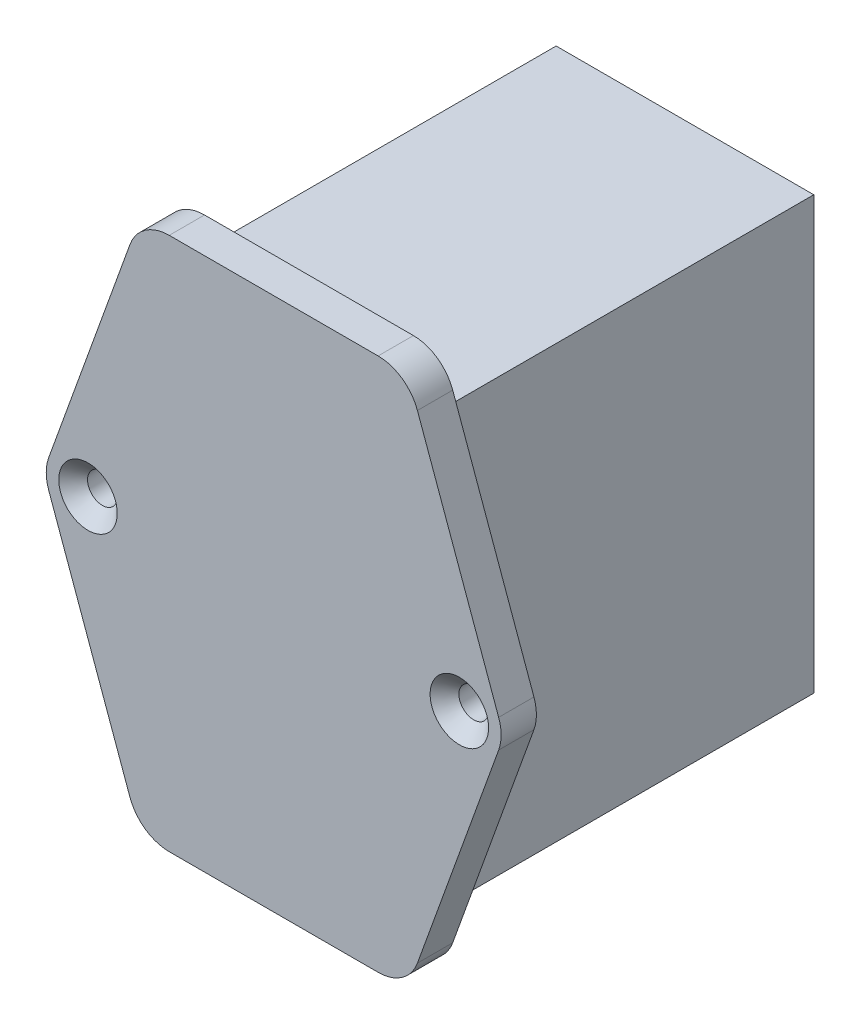
ISO-10303-21;
HEADER;
FILE_DESCRIPTION(('STEP AP214'),'2;1');
FILE_NAME('part.step','',(''),(''),'','','');
FILE_SCHEMA(('AUTOMOTIVE_DESIGN { 1 0 10303 214 1 1 1 1 }'));
ENDSEC;
DATA;
#1=APPLICATION_CONTEXT('core data for automotive mechanical design processes');
#2=APPLICATION_PROTOCOL_DEFINITION('international standard','automotive_design',2000,#1);
#3=PRODUCT_CONTEXT('',#1,'mechanical');
#4=PRODUCT('Part','Part','',(#3));
#5=PRODUCT_RELATED_PRODUCT_CATEGORY('part','',(#4));
#6=PRODUCT_DEFINITION_FORMATION('','',#4);
#7=PRODUCT_DEFINITION_CONTEXT('part definition',#1,'design');
#8=PRODUCT_DEFINITION('design','',#6,#7);
#9=PRODUCT_DEFINITION_SHAPE('','',#8);
#10=(LENGTH_UNIT() NAMED_UNIT(*) SI_UNIT(.MILLI.,.METRE.));
#11=(NAMED_UNIT(*) PLANE_ANGLE_UNIT() SI_UNIT($,.RADIAN.));
#12=(NAMED_UNIT(*) SI_UNIT($,.STERADIAN.) SOLID_ANGLE_UNIT());
#13=UNCERTAINTY_MEASURE_WITH_UNIT(LENGTH_MEASURE(1.E-05),#10,'distance_accuracy_value','');
#14=(GEOMETRIC_REPRESENTATION_CONTEXT(3) GLOBAL_UNCERTAINTY_ASSIGNED_CONTEXT((#13)) GLOBAL_UNIT_ASSIGNED_CONTEXT((#10,
#11,#12)) REPRESENTATION_CONTEXT('',''));
#15=CARTESIAN_POINT('',(0.,0.,0.));
#16=DIRECTION('',(0.,0.,1.));
#17=DIRECTION('',(1.,0.,0.));
#18=AXIS2_PLACEMENT_3D('',#15,#16,#17);
#19=CARTESIAN_POINT('',(0.,0.,0.));
#20=DIRECTION('',(0.,0.,-1.));
#21=DIRECTION('',(-1.,0.,0.));
#22=AXIS2_PLACEMENT_3D('',#19,#20,#21);
#23=PLANE('',#22);
#24=DIRECTION('',(0.,1.,0.));
#25=VECTOR('',#24,1.);
#26=CARTESIAN_POINT('',(27.75,0.,0.));
#27=LINE('',#26,#25);
#28=CARTESIAN_POINT('',(27.75,46.5,0.));
#29=VERTEX_POINT('',#28);
#30=CARTESIAN_POINT('',(27.75,0.,0.));
#31=VERTEX_POINT('',#30);
#32=EDGE_CURVE('E233',#29,#31,#27,.F.);
#33=ORIENTED_EDGE('',*,*,#32,.T.);
#34=DIRECTION('',(1.,0.,0.));
#35=VECTOR('',#34,1.);
#36=CARTESIAN_POINT('',(0.,0.,0.));
#37=LINE('',#36,#35);
#38=CARTESIAN_POINT('',(0.,0.,0.));
#39=VERTEX_POINT('',#38);
#40=EDGE_CURVE('E227',#31,#39,#37,.F.);
#41=ORIENTED_EDGE('',*,*,#40,.T.);
#42=DIRECTION('',(0.,1.,0.));
#43=VECTOR('',#42,1.);
#44=CARTESIAN_POINT('',(0.,0.,0.));
#45=LINE('',#44,#43);
#46=CARTESIAN_POINT('',(0.,46.5,0.));
#47=VERTEX_POINT('',#46);
#48=EDGE_CURVE('E221',#39,#47,#45,.T.);
#49=ORIENTED_EDGE('',*,*,#48,.T.);
#50=DIRECTION('',(1.,0.,0.));
#51=VECTOR('',#50,1.);
#52=CARTESIAN_POINT('',(0.,46.5,0.));
#53=LINE('',#52,#51);
#54=EDGE_CURVE('E117',#47,#29,#53,.T.);
#55=ORIENTED_EDGE('',*,*,#54,.T.);
#56=EDGE_LOOP('',(#33,#41,#49,#55));
#57=FACE_BOUND('',#56,.T.);
#58=ADVANCED_FACE('F17',(#57),#23,.T.);
#59=CARTESIAN_POINT('',(27.75,0.,40.5));
#60=DIRECTION('',(-1.,0.,0.));
#61=DIRECTION('',(0.,0.,1.));
#62=AXIS2_PLACEMENT_3D('',#59,#60,#61);
#63=PLANE('',#62);
#64=DIRECTION('',(0.,0.,-1.));
#65=VECTOR('',#64,1.);
#66=CARTESIAN_POINT('',(27.75,46.5,40.5));
#67=LINE('',#66,#65);
#68=CARTESIAN_POINT('',(27.75,46.5,40.5));
#69=VERTEX_POINT('',#68);
#70=EDGE_CURVE('E218',#29,#69,#67,.F.);
#71=ORIENTED_EDGE('',*,*,#70,.T.);
#72=DIRECTION('',(0.,1.,0.));
#73=VECTOR('',#72,1.);
#74=CARTESIAN_POINT('',(27.75,23.55,40.5));
#75=LINE('',#74,#73);
#76=CARTESIAN_POINT('',(27.75,0.,40.5));
#77=VERTEX_POINT('',#76);
#78=EDGE_CURVE('E192',#69,#77,#75,.F.);
#79=ORIENTED_EDGE('',*,*,#78,.T.);
#80=DIRECTION('',(0.,0.,1.));
#81=VECTOR('',#80,1.);
#82=CARTESIAN_POINT('',(27.75,0.,40.5));
#83=LINE('',#82,#81);
#84=EDGE_CURVE('E230',#77,#31,#83,.F.);
#85=ORIENTED_EDGE('',*,*,#84,.T.);
#86=ORIENTED_EDGE('',*,*,#32,.F.);
#87=EDGE_LOOP('',(#71,#79,#85,#86));
#88=FACE_BOUND('',#87,.T.);
#89=ADVANCED_FACE('F470',(#88),#63,.F.);
#90=CARTESIAN_POINT('',(0.,0.,40.5));
#91=DIRECTION('',(0.,1.,0.));
#92=DIRECTION('',(0.,0.,1.));
#93=AXIS2_PLACEMENT_3D('',#90,#91,#92);
#94=PLANE('',#93);
#95=ORIENTED_EDGE('',*,*,#84,.F.);
#96=DIRECTION('',(1.,0.,0.));
#97=VECTOR('',#96,1.);
#98=CARTESIAN_POINT('',(33.875,0.,40.5));
#99=LINE('',#98,#97);
#100=CARTESIAN_POINT('',(0.,0.,40.5));
#101=VERTEX_POINT('',#100);
#102=EDGE_CURVE('E189',#77,#101,#99,.F.);
#103=ORIENTED_EDGE('',*,*,#102,.T.);
#104=DIRECTION('',(0.,0.,-1.));
#105=VECTOR('',#104,1.);
#106=CARTESIAN_POINT('',(0.,0.,40.5));
#107=LINE('',#106,#105);
#108=EDGE_CURVE('E224',#101,#39,#107,.T.);
#109=ORIENTED_EDGE('',*,*,#108,.T.);
#110=ORIENTED_EDGE('',*,*,#40,.F.);
#111=EDGE_LOOP('',(#95,#103,#109,#110));
#112=FACE_BOUND('',#111,.T.);
#113=ADVANCED_FACE('F461',(#112),#94,.F.);
#114=CARTESIAN_POINT('',(0.,0.,40.5));
#115=DIRECTION('',(1.,0.,0.));
#116=DIRECTION('',(0.,0.,-1.));
#117=AXIS2_PLACEMENT_3D('',#114,#115,#116);
#118=PLANE('',#117);
#119=ORIENTED_EDGE('',*,*,#108,.F.);
#120=DIRECTION('',(0.,1.,0.));
#121=VECTOR('',#120,1.);
#122=CARTESIAN_POINT('',(0.,23.55,40.5));
#123=LINE('',#122,#121);
#124=CARTESIAN_POINT('',(0.,46.5,40.5));
#125=VERTEX_POINT('',#124);
#126=EDGE_CURVE('E186',#101,#125,#123,.T.);
#127=ORIENTED_EDGE('',*,*,#126,.T.);
#128=DIRECTION('',(0.,0.,-1.));
#129=VECTOR('',#128,1.);
#130=CARTESIAN_POINT('',(0.,46.5,40.5));
#131=LINE('',#130,#129);
#132=EDGE_CURVE('E215',#125,#47,#131,.T.);
#133=ORIENTED_EDGE('',*,*,#132,.T.);
#134=ORIENTED_EDGE('',*,*,#48,.F.);
#135=EDGE_LOOP('',(#119,#127,#133,#134));
#136=FACE_BOUND('',#135,.T.);
#137=ADVANCED_FACE('F452',(#136),#118,.F.);
#138=CARTESIAN_POINT('',(0.,46.5,40.5));
#139=DIRECTION('',(0.,-1.,0.));
#140=DIRECTION('',(0.,0.,-1.));
#141=AXIS2_PLACEMENT_3D('',#138,#139,#140);
#142=PLANE('',#141);
#143=ORIENTED_EDGE('',*,*,#132,.F.);
#144=DIRECTION('',(1.,0.,0.));
#145=VECTOR('',#144,1.);
#146=CARTESIAN_POINT('',(33.875,46.5,40.5));
#147=LINE('',#146,#145);
#148=EDGE_CURVE('E182',#125,#69,#147,.T.);
#149=ORIENTED_EDGE('',*,*,#148,.T.);
#150=ORIENTED_EDGE('',*,*,#70,.F.);
#151=ORIENTED_EDGE('',*,*,#54,.F.);
#152=EDGE_LOOP('',(#143,#149,#150,#151));
#153=FACE_BOUND('',#152,.T.);
#154=ADVANCED_FACE('F443',(#153),#142,.F.);
#155=CARTESIAN_POINT('',(-6.125,23.55,44.3));
#156=DIRECTION('',(0.,0.,-1.));
#157=DIRECTION('',(-1.,0.,0.));
#158=AXIS2_PLACEMENT_3D('',#155,#156,#157);
#159=CYLINDRICAL_SURFACE('',#158,1.6);
#160=CARTESIAN_POINT('',(-6.125,23.55,40.5));
#161=DIRECTION('',(0.,0.,-1.));
#162=DIRECTION('',(-1.,0.,0.));
#163=AXIS2_PLACEMENT_3D('',#160,#161,#162);
#164=CIRCLE('',#163,1.6);
#165=CARTESIAN_POINT('',(-7.725,23.55,40.5));
#166=VERTEX_POINT('',#165);
#167=EDGE_CURVE('E256',#166,#166,#164,.T.);
#168=ORIENTED_EDGE('',*,*,#167,.T.);
#169=EDGE_LOOP('',(#168));
#170=FACE_BOUND('',#169,.T.);
#171=CARTESIAN_POINT('',(-6.125,23.55,42.7500000000123));
#172=DIRECTION('',(0.,0.,1.));
#173=DIRECTION('',(1.,0.,0.));
#174=AXIS2_PLACEMENT_3D('',#171,#172,#173);
#175=CIRCLE('',#174,1.599999999999);
#176=CARTESIAN_POINT('',(-4.525000000001,23.55,42.7500000000123));
#177=VERTEX_POINT('',#176);
#178=EDGE_CURVE('E185',#177,#177,#175,.T.);
#179=ORIENTED_EDGE('',*,*,#178,.T.);
#180=EDGE_LOOP('',(#179));
#181=FACE_BOUND('',#180,.T.);
#182=ADVANCED_FACE('F434',(#170,#181),#159,.F.);
#183=CARTESIAN_POINT('',(33.875,23.55,44.3));
#184=DIRECTION('',(0.,0.,-1.));
#185=DIRECTION('',(-1.,0.,0.));
#186=AXIS2_PLACEMENT_3D('',#183,#184,#185);
#187=CYLINDRICAL_SURFACE('',#186,1.6);
#188=CARTESIAN_POINT('',(33.875,23.55,40.5));
#189=DIRECTION('',(0.,0.,-1.));
#190=DIRECTION('',(-1.,0.,0.));
#191=AXIS2_PLACEMENT_3D('',#188,#189,#190);
#192=CIRCLE('',#191,1.6);
#193=CARTESIAN_POINT('',(32.275,23.55,40.5));
#194=VERTEX_POINT('',#193);
#195=EDGE_CURVE('E195',#194,#194,#192,.T.);
#196=ORIENTED_EDGE('',*,*,#195,.T.);
#197=EDGE_LOOP('',(#196));
#198=FACE_BOUND('',#197,.T.);
#199=CARTESIAN_POINT('',(33.875,23.55,42.7499999999554));
#200=DIRECTION('',(0.,0.,1.));
#201=DIRECTION('',(1.,0.,0.));
#202=AXIS2_PLACEMENT_3D('',#199,#200,#201);
#203=CIRCLE('',#202,1.59999999996262);
#204=CARTESIAN_POINT('',(35.4749999999626,23.55,42.7499999999554));
#205=VERTEX_POINT('',#204);
#206=EDGE_CURVE('E208',#205,#205,#203,.T.);
#207=ORIENTED_EDGE('',*,*,#206,.T.);
#208=EDGE_LOOP('',(#207));
#209=FACE_BOUND('',#208,.T.);
#210=ADVANCED_FACE('F426',(#198,#209),#187,.F.);
#211=CARTESIAN_POINT('',(-6.125,23.55,44.3));
#212=DIRECTION('',(0.,0.,-1.));
#213=DIRECTION('',(-1.,0.,0.));
#214=AXIS2_PLACEMENT_3D('',#211,#212,#213);
#215=CYLINDRICAL_SURFACE('',#214,4.5);
#216=CARTESIAN_POINT('',(-6.125,23.55,40.5));
#217=DIRECTION('',(0.,0.,-1.));
#218=DIRECTION('',(-1.,0.,0.));
#219=AXIS2_PLACEMENT_3D('',#216,#217,#218);
#220=CIRCLE('',#219,4.5);
#221=CARTESIAN_POINT('',(-10.3578796435891,25.0773277064497,40.5));
#222=VERTEX_POINT('',#221);
#223=CARTESIAN_POINT('',(-10.3578796435891,22.0226722935503,40.5));
#224=VERTEX_POINT('',#223);
#225=EDGE_CURVE('E116',#222,#224,#220,.F.);
#226=ORIENTED_EDGE('',*,*,#225,.T.);
#227=DIRECTION('',(0.,0.,1.));
#228=VECTOR('',#227,1.);
#229=CARTESIAN_POINT('',(-10.3578796435891,22.0226722935503,44.3));
#230=LINE('',#229,#228);
#231=CARTESIAN_POINT('',(-10.3578796435891,22.0226722935503,44.3));
#232=VERTEX_POINT('',#231);
#233=EDGE_CURVE('E114',#224,#232,#230,.T.);
#234=ORIENTED_EDGE('',*,*,#233,.T.);
#235=CARTESIAN_POINT('',(-6.125,23.55,44.3));
#236=DIRECTION('',(0.,0.,-1.));
#237=DIRECTION('',(-1.,0.,0.));
#238=AXIS2_PLACEMENT_3D('',#235,#236,#237);
#239=CIRCLE('',#238,4.5);
#240=CARTESIAN_POINT('',(-10.3578796435891,25.0773277064497,44.3));
#241=VERTEX_POINT('',#240);
#242=EDGE_CURVE('E20',#232,#241,#239,.T.);
#243=ORIENTED_EDGE('',*,*,#242,.T.);
#244=DIRECTION('',(0.,0.,1.));
#245=VECTOR('',#244,1.);
#246=CARTESIAN_POINT('',(-10.3578796435891,25.0773277064497,44.3));
#247=LINE('',#246,#245);
#248=EDGE_CURVE('E111',#241,#222,#247,.F.);
#249=ORIENTED_EDGE('',*,*,#248,.T.);
#250=EDGE_LOOP('',(#226,#234,#243,#249));
#251=FACE_BOUND('',#250,.T.);
#252=ADVANCED_FACE('F110',(#251),#215,.T.);
#253=CARTESIAN_POINT('',(33.875,23.55,40.5));
#254=DIRECTION('',(0.,0.,1.));
#255=DIRECTION('',(1.,0.,0.));
#256=AXIS2_PLACEMENT_3D('',#253,#254,#255);
#257=PLANE('',#256);
#258=ORIENTED_EDGE('',*,*,#126,.F.);
#259=ORIENTED_EDGE('',*,*,#102,.F.);
#260=ORIENTED_EDGE('',*,*,#78,.F.);
#261=ORIENTED_EDGE('',*,*,#148,.F.);
#262=EDGE_LOOP('',(#258,#259,#260,#261));
#263=FACE_BOUND('',#262,.T.);
#264=ORIENTED_EDGE('',*,*,#195,.F.);
#265=EDGE_LOOP('',(#264));
#266=FACE_BOUND('',#265,.T.);
#267=ORIENTED_EDGE('',*,*,#167,.F.);
#268=EDGE_LOOP('',(#267));
#269=FACE_BOUND('',#268,.T.);
#270=DIRECTION('',(-0.339406156988818,-0.940639920797582,0.));
#271=VECTOR('',#270,1.);
#272=CARTESIAN_POINT('',(29.3578796435891,-2.22732770644969,40.5));
#273=LINE('',#272,#271);
#274=CARTESIAN_POINT('',(38.1078796435891,22.0226722935503,40.5));
#275=VERTEX_POINT('',#274);
#276=CARTESIAN_POINT('',(29.3578796435891,-2.22732770644969,40.5));
#277=VERTEX_POINT('',#276);
#278=EDGE_CURVE('E153',#275,#277,#273,.T.);
#279=ORIENTED_EDGE('',*,*,#278,.T.);
#280=CARTESIAN_POINT('',(25.125,-0.700000000000004,40.5));
#281=DIRECTION('',(0.,0.,-1.));
#282=DIRECTION('',(-1.,0.,0.));
#283=AXIS2_PLACEMENT_3D('',#280,#281,#282);
#284=CIRCLE('',#283,4.5);
#285=CARTESIAN_POINT('',(25.125,-5.2,40.5));
#286=VERTEX_POINT('',#285);
#287=EDGE_CURVE('E156',#286,#277,#284,.F.);
#288=ORIENTED_EDGE('',*,*,#287,.F.);
#289=DIRECTION('',(-1.,0.,0.));
#290=VECTOR('',#289,1.);
#291=CARTESIAN_POINT('',(2.625,-5.2,40.5));
#292=LINE('',#291,#290);
#293=CARTESIAN_POINT('',(2.625,-5.2,40.5));
#294=VERTEX_POINT('',#293);
#295=EDGE_CURVE('E159',#286,#294,#292,.T.);
#296=ORIENTED_EDGE('',*,*,#295,.T.);
#297=CARTESIAN_POINT('',(2.625,-0.700000000000004,40.5));
#298=DIRECTION('',(0.,0.,-1.));
#299=DIRECTION('',(-1.,0.,0.));
#300=AXIS2_PLACEMENT_3D('',#297,#298,#299);
#301=CIRCLE('',#300,4.5);
#302=CARTESIAN_POINT('',(-1.60787964358912,-2.22732770644969,40.5));
#303=VERTEX_POINT('',#302);
#304=EDGE_CURVE('E163',#303,#294,#301,.F.);
#305=ORIENTED_EDGE('',*,*,#304,.F.);
#306=DIRECTION('',(-0.339406156988818,0.940639920797582,0.));
#307=VECTOR('',#306,1.);
#308=CARTESIAN_POINT('',(-10.3578796435891,22.0226722935503,40.5));
#309=LINE('',#308,#307);
#310=EDGE_CURVE('E165',#303,#224,#309,.T.);
#311=ORIENTED_EDGE('',*,*,#310,.T.);
#312=ORIENTED_EDGE('',*,*,#225,.F.);
#313=DIRECTION('',(0.339406156988818,0.940639920797582,0.));
#314=VECTOR('',#313,1.);
#315=CARTESIAN_POINT('',(-1.60787964358912,49.3273277064497,40.5));
#316=LINE('',#315,#314);
#317=CARTESIAN_POINT('',(-1.60787964358912,49.3273277064497,40.5));
#318=VERTEX_POINT('',#317);
#319=EDGE_CURVE('E125',#222,#318,#316,.T.);
#320=ORIENTED_EDGE('',*,*,#319,.T.);
#321=CARTESIAN_POINT('',(2.625,47.8,40.5));
#322=DIRECTION('',(0.,0.,-1.));
#323=DIRECTION('',(-1.,0.,0.));
#324=AXIS2_PLACEMENT_3D('',#321,#322,#323);
#325=CIRCLE('',#324,4.5);
#326=CARTESIAN_POINT('',(2.625,52.3,40.5));
#327=VERTEX_POINT('',#326);
#328=EDGE_CURVE('E170',#327,#318,#325,.F.);
#329=ORIENTED_EDGE('',*,*,#328,.F.);
#330=DIRECTION('',(1.,0.,0.));
#331=VECTOR('',#330,1.);
#332=CARTESIAN_POINT('',(25.125,52.3,40.5));
#333=LINE('',#332,#331);
#334=CARTESIAN_POINT('',(25.125,52.3,40.5));
#335=VERTEX_POINT('',#334);
#336=EDGE_CURVE('E173',#327,#335,#333,.T.);
#337=ORIENTED_EDGE('',*,*,#336,.T.);
#338=CARTESIAN_POINT('',(25.125,47.8,40.5));
#339=DIRECTION('',(0.,0.,-1.));
#340=DIRECTION('',(-1.,0.,0.));
#341=AXIS2_PLACEMENT_3D('',#338,#339,#340);
#342=CIRCLE('',#341,4.5);
#343=CARTESIAN_POINT('',(29.3578796435891,49.3273277064497,40.5));
#344=VERTEX_POINT('',#343);
#345=EDGE_CURVE('E177',#344,#335,#342,.F.);
#346=ORIENTED_EDGE('',*,*,#345,.F.);
#347=DIRECTION('',(0.339406156988818,-0.940639920797582,0.));
#348=VECTOR('',#347,1.);
#349=CARTESIAN_POINT('',(38.1078796435891,25.0773277064497,40.5));
#350=LINE('',#349,#348);
#351=CARTESIAN_POINT('',(38.1078796435891,25.0773277064497,40.5));
#352=VERTEX_POINT('',#351);
#353=EDGE_CURVE('E180',#344,#352,#350,.T.);
#354=ORIENTED_EDGE('',*,*,#353,.T.);
#355=CARTESIAN_POINT('',(33.875,23.55,40.5));
#356=DIRECTION('',(0.,0.,-1.));
#357=DIRECTION('',(-1.,0.,0.));
#358=AXIS2_PLACEMENT_3D('',#355,#356,#357);
#359=CIRCLE('',#358,4.5);
#360=EDGE_CURVE('E181',#275,#352,#359,.F.);
#361=ORIENTED_EDGE('',*,*,#360,.F.);
#362=EDGE_LOOP('',(#279,#288,#296,#305,#311,#312,#320,#329,#337,#346,#354,#361));
#363=FACE_BOUND('',#362,.T.);
#364=ADVANCED_FACE('F260',(#263,#266,#269,#363),#257,.F.);
#365=CARTESIAN_POINT('',(-6.125,23.55,44.2999999999074));
#366=DIRECTION('',(0.,0.,1.));
#367=DIRECTION('',(1.,0.,0.));
#368=AXIS2_PLACEMENT_3D('',#365,#366,#367);
#369=CONICAL_SURFACE('',#368,3.14999999989413,0.785398163397448);
#370=CARTESIAN_POINT('',(-6.125,23.55,44.2999999999643));
#371=DIRECTION('',(0.,0.,1.));
#372=DIRECTION('',(1.,0.,0.));
#373=AXIS2_PLACEMENT_3D('',#370,#371,#372);
#374=CIRCLE('',#373,3.14999999995098);
#375=CARTESIAN_POINT('',(-2.97500000004902,23.55,44.2999999999643));
#376=VERTEX_POINT('',#375);
#377=EDGE_CURVE('E198',#376,#376,#374,.F.);
#378=ORIENTED_EDGE('',*,*,#377,.F.);
#379=EDGE_LOOP('',(#378));
#380=FACE_BOUND('',#379,.T.);
#381=ORIENTED_EDGE('',*,*,#178,.F.);
#382=EDGE_LOOP('',(#381));
#383=FACE_BOUND('',#382,.T.);
#384=ADVANCED_FACE('F401',(#380,#383),#369,.F.);
#385=CARTESIAN_POINT('',(33.875,23.55,44.2999999999643));
#386=DIRECTION('',(0.,0.,1.));
#387=DIRECTION('',(1.,0.,0.));
#388=AXIS2_PLACEMENT_3D('',#385,#386,#387);
#389=CONICAL_SURFACE('',#388,3.14999999997144,0.785398163397448);
#390=CARTESIAN_POINT('',(33.875,23.55,44.3000000000211));
#391=DIRECTION('',(0.,0.,1.));
#392=DIRECTION('',(1.,0.,0.));
#393=AXIS2_PLACEMENT_3D('',#390,#391,#392);
#394=CIRCLE('',#393,3.15000000002828);
#395=CARTESIAN_POINT('',(37.0250000000283,23.55,44.3000000000211));
#396=VERTEX_POINT('',#395);
#397=EDGE_CURVE('E244',#396,#396,#394,.F.);
#398=ORIENTED_EDGE('',*,*,#397,.F.);
#399=EDGE_LOOP('',(#398));
#400=FACE_BOUND('',#399,.T.);
#401=ORIENTED_EDGE('',*,*,#206,.F.);
#402=EDGE_LOOP('',(#401));
#403=FACE_BOUND('',#402,.T.);
#404=ADVANCED_FACE('F393',(#400,#403),#389,.F.);
#405=CARTESIAN_POINT('',(33.875,23.55,44.3));
#406=DIRECTION('',(0.,0.,-1.));
#407=DIRECTION('',(-1.,0.,0.));
#408=AXIS2_PLACEMENT_3D('',#405,#406,#407);
#409=CYLINDRICAL_SURFACE('',#408,4.5);
#410=CARTESIAN_POINT('',(33.875,23.55,44.3));
#411=DIRECTION('',(0.,0.,-1.));
#412=DIRECTION('',(-1.,0.,0.));
#413=AXIS2_PLACEMENT_3D('',#410,#411,#412);
#414=CIRCLE('',#413,4.5);
#415=CARTESIAN_POINT('',(38.1078796435891,22.0226722935503,44.3));
#416=VERTEX_POINT('',#415);
#417=CARTESIAN_POINT('',(38.1078796435891,25.0773277064497,44.3));
#418=VERTEX_POINT('',#417);
#419=EDGE_CURVE('E147',#416,#418,#414,.F.);
#420=ORIENTED_EDGE('',*,*,#419,.F.);
#421=DIRECTION('',(0.,0.,1.));
#422=VECTOR('',#421,1.);
#423=CARTESIAN_POINT('',(38.1078796435891,22.0226722935503,44.3));
#424=LINE('',#423,#422);
#425=EDGE_CURVE('E149',#416,#275,#424,.F.);
#426=ORIENTED_EDGE('',*,*,#425,.T.);
#427=ORIENTED_EDGE('',*,*,#360,.T.);
#428=DIRECTION('',(0.,0.,1.));
#429=VECTOR('',#428,1.);
#430=CARTESIAN_POINT('',(38.1078796435891,25.0773277064497,44.3));
#431=LINE('',#430,#429);
#432=EDGE_CURVE('E178',#352,#418,#431,.T.);
#433=ORIENTED_EDGE('',*,*,#432,.T.);
#434=EDGE_LOOP('',(#420,#426,#427,#433));
#435=FACE_BOUND('',#434,.T.);
#436=ADVANCED_FACE('F278',(#435),#409,.T.);
#437=CARTESIAN_POINT('',(38.1078796435891,25.0773277064497,44.3));
#438=DIRECTION('',(-0.940639920797582,-0.339406156988818,0.));
#439=DIRECTION('',(0.339406156988818,-0.940639920797582,0.));
#440=AXIS2_PLACEMENT_3D('',#437,#438,#439);
#441=PLANE('',#440);
#442=DIRECTION('',(0.,0.,-1.));
#443=VECTOR('',#442,1.);
#444=CARTESIAN_POINT('',(29.3578796435891,49.3273277064497,44.3));
#445=LINE('',#444,#443);
#446=CARTESIAN_POINT('',(29.3578796435891,49.3273277064497,44.3));
#447=VERTEX_POINT('',#446);
#448=EDGE_CURVE('E174',#447,#344,#445,.T.);
#449=ORIENTED_EDGE('',*,*,#448,.F.);
#450=DIRECTION('',(-0.339406156988818,0.940639920797582,0.));
#451=VECTOR('',#450,1.);
#452=CARTESIAN_POINT('',(38.1078796435891,25.0773277064497,44.3));
#453=LINE('',#452,#451);
#454=EDGE_CURVE('E144',#418,#447,#453,.T.);
#455=ORIENTED_EDGE('',*,*,#454,.F.);
#456=ORIENTED_EDGE('',*,*,#432,.F.);
#457=ORIENTED_EDGE('',*,*,#353,.F.);
#458=EDGE_LOOP('',(#449,#455,#456,#457));
#459=FACE_BOUND('',#458,.T.);
#460=ADVANCED_FACE('F283',(#459),#441,.F.);
#461=CARTESIAN_POINT('',(25.125,47.8,44.3));
#462=DIRECTION('',(0.,0.,-1.));
#463=DIRECTION('',(-1.,0.,0.));
#464=AXIS2_PLACEMENT_3D('',#461,#462,#463);
#465=CYLINDRICAL_SURFACE('',#464,4.5);
#466=CARTESIAN_POINT('',(25.125,47.8,44.3));
#467=DIRECTION('',(0.,0.,-1.));
#468=DIRECTION('',(-1.,0.,0.));
#469=AXIS2_PLACEMENT_3D('',#466,#467,#468);
#470=CIRCLE('',#469,4.5);
#471=CARTESIAN_POINT('',(25.125,52.3,44.3));
#472=VERTEX_POINT('',#471);
#473=EDGE_CURVE('E143',#447,#472,#470,.F.);
#474=ORIENTED_EDGE('',*,*,#473,.F.);
#475=ORIENTED_EDGE('',*,*,#448,.T.);
#476=ORIENTED_EDGE('',*,*,#345,.T.);
#477=DIRECTION('',(0.,0.,1.));
#478=VECTOR('',#477,1.);
#479=CARTESIAN_POINT('',(25.125,52.3,44.3));
#480=LINE('',#479,#478);
#481=EDGE_CURVE('E171',#335,#472,#480,.T.);
#482=ORIENTED_EDGE('',*,*,#481,.T.);
#483=EDGE_LOOP('',(#474,#475,#476,#482));
#484=FACE_BOUND('',#483,.T.);
#485=ADVANCED_FACE('F287',(#484),#465,.T.);
#486=CARTESIAN_POINT('',(25.125,52.3,44.3));
#487=DIRECTION('',(0.,-1.,0.));
#488=DIRECTION('',(1.,0.,0.));
#489=AXIS2_PLACEMENT_3D('',#486,#487,#488);
#490=PLANE('',#489);
#491=DIRECTION('',(0.,0.,-1.));
#492=VECTOR('',#491,1.);
#493=CARTESIAN_POINT('',(2.625,52.3,44.3));
#494=LINE('',#493,#492);
#495=CARTESIAN_POINT('',(2.625,52.3,44.3));
#496=VERTEX_POINT('',#495);
#497=EDGE_CURVE('E166',#496,#327,#494,.T.);
#498=ORIENTED_EDGE('',*,*,#497,.F.);
#499=DIRECTION('',(1.,0.,0.));
#500=VECTOR('',#499,1.);
#501=CARTESIAN_POINT('',(33.875,52.3,44.3));
#502=LINE('',#501,#500);
#503=EDGE_CURVE('E138',#472,#496,#502,.F.);
#504=ORIENTED_EDGE('',*,*,#503,.F.);
#505=ORIENTED_EDGE('',*,*,#481,.F.);
#506=ORIENTED_EDGE('',*,*,#336,.F.);
#507=EDGE_LOOP('',(#498,#504,#505,#506));
#508=FACE_BOUND('',#507,.T.);
#509=ADVANCED_FACE('F291',(#508),#490,.F.);
#510=CARTESIAN_POINT('',(2.625,47.8,44.3));
#511=DIRECTION('',(0.,0.,-1.));
#512=DIRECTION('',(-1.,0.,0.));
#513=AXIS2_PLACEMENT_3D('',#510,#511,#512);
#514=CYLINDRICAL_SURFACE('',#513,4.5);
#515=CARTESIAN_POINT('',(2.625,47.8,44.3));
#516=DIRECTION('',(0.,0.,-1.));
#517=DIRECTION('',(-1.,0.,0.));
#518=AXIS2_PLACEMENT_3D('',#515,#516,#517);
#519=CIRCLE('',#518,4.5);
#520=CARTESIAN_POINT('',(-1.60787964358912,49.3273277064497,44.3));
#521=VERTEX_POINT('',#520);
#522=EDGE_CURVE('E133',#496,#521,#519,.F.);
#523=ORIENTED_EDGE('',*,*,#522,.F.);
#524=ORIENTED_EDGE('',*,*,#497,.T.);
#525=ORIENTED_EDGE('',*,*,#328,.T.);
#526=DIRECTION('',(0.,0.,1.));
#527=VECTOR('',#526,1.);
#528=CARTESIAN_POINT('',(-1.60787964358912,49.3273277064497,44.3));
#529=LINE('',#528,#527);
#530=EDGE_CURVE('E126',#318,#521,#529,.T.);
#531=ORIENTED_EDGE('',*,*,#530,.T.);
#532=EDGE_LOOP('',(#523,#524,#525,#531));
#533=FACE_BOUND('',#532,.T.);
#534=ADVANCED_FACE('F293',(#533),#514,.T.);
#535=CARTESIAN_POINT('',(-1.60787964358912,49.3273277064497,44.3));
#536=DIRECTION('',(0.940639920797582,-0.339406156988818,0.));
#537=DIRECTION('',(0.339406156988818,0.940639920797582,0.));
#538=AXIS2_PLACEMENT_3D('',#535,#536,#537);
#539=PLANE('',#538);
#540=ORIENTED_EDGE('',*,*,#248,.F.);
#541=DIRECTION('',(-0.339406156988818,-0.940639920797582,0.));
#542=VECTOR('',#541,1.);
#543=CARTESIAN_POINT('',(-1.60787964358912,49.3273277064497,44.3));
#544=LINE('',#543,#542);
#545=EDGE_CURVE('E122',#521,#241,#544,.T.);
#546=ORIENTED_EDGE('',*,*,#545,.F.);
#547=ORIENTED_EDGE('',*,*,#530,.F.);
#548=ORIENTED_EDGE('',*,*,#319,.F.);
#549=EDGE_LOOP('',(#540,#546,#547,#548));
#550=FACE_BOUND('',#549,.T.);
#551=ADVANCED_FACE('F120',(#550),#539,.F.);
#552=CARTESIAN_POINT('',(-10.3578796435891,22.0226722935503,44.3));
#553=DIRECTION('',(0.940639920797582,0.339406156988818,0.));
#554=DIRECTION('',(-0.339406156988818,0.940639920797582,0.));
#555=AXIS2_PLACEMENT_3D('',#552,#553,#554);
#556=PLANE('',#555);
#557=DIRECTION('',(0.,0.,-1.));
#558=VECTOR('',#557,1.);
#559=CARTESIAN_POINT('',(-1.60787964358912,-2.22732770644969,44.3));
#560=LINE('',#559,#558);
#561=CARTESIAN_POINT('',(-1.60787964358912,-2.22732770644969,44.3));
#562=VERTEX_POINT('',#561);
#563=EDGE_CURVE('E160',#562,#303,#560,.T.);
#564=ORIENTED_EDGE('',*,*,#563,.F.);
#565=DIRECTION('',(0.339406156988818,-0.940639920797582,0.));
#566=VECTOR('',#565,1.);
#567=CARTESIAN_POINT('',(-10.3578796435891,22.0226722935503,44.3));
#568=LINE('',#567,#566);
#569=EDGE_CURVE('E134',#232,#562,#568,.T.);
#570=ORIENTED_EDGE('',*,*,#569,.F.);
#571=ORIENTED_EDGE('',*,*,#233,.F.);
#572=ORIENTED_EDGE('',*,*,#310,.F.);
#573=EDGE_LOOP('',(#564,#570,#571,#572));
#574=FACE_BOUND('',#573,.T.);
#575=ADVANCED_FACE('F262',(#574),#556,.F.);
#576=CARTESIAN_POINT('',(2.625,-0.700000000000004,44.3));
#577=DIRECTION('',(0.,0.,-1.));
#578=DIRECTION('',(-1.,0.,0.));
#579=AXIS2_PLACEMENT_3D('',#576,#577,#578);
#580=CYLINDRICAL_SURFACE('',#579,4.5);
#581=CARTESIAN_POINT('',(2.625,-0.700000000000004,44.3));
#582=DIRECTION('',(0.,0.,-1.));
#583=DIRECTION('',(-1.,0.,0.));
#584=AXIS2_PLACEMENT_3D('',#581,#582,#583);
#585=CIRCLE('',#584,4.5);
#586=CARTESIAN_POINT('',(2.625,-5.20000000000001,44.3));
#587=VERTEX_POINT('',#586);
#588=EDGE_CURVE('E136',#562,#587,#585,.F.);
#589=ORIENTED_EDGE('',*,*,#588,.F.);
#590=ORIENTED_EDGE('',*,*,#563,.T.);
#591=ORIENTED_EDGE('',*,*,#304,.T.);
#592=DIRECTION('',(0.,0.,1.));
#593=VECTOR('',#592,1.);
#594=CARTESIAN_POINT('',(2.625,-5.2,44.3));
#595=LINE('',#594,#593);
#596=EDGE_CURVE('E157',#294,#587,#595,.T.);
#597=ORIENTED_EDGE('',*,*,#596,.T.);
#598=EDGE_LOOP('',(#589,#590,#591,#597));
#599=FACE_BOUND('',#598,.T.);
#600=ADVANCED_FACE('F267',(#599),#580,.T.);
#601=CARTESIAN_POINT('',(2.625,-5.2,44.3));
#602=DIRECTION('',(0.,1.,0.));
#603=DIRECTION('',(-1.,0.,0.));
#604=AXIS2_PLACEMENT_3D('',#601,#602,#603);
#605=PLANE('',#604);
#606=DIRECTION('',(0.,0.,-1.));
#607=VECTOR('',#606,1.);
#608=CARTESIAN_POINT('',(25.125,-5.20000000000001,44.3));
#609=LINE('',#608,#607);
#610=CARTESIAN_POINT('',(25.125,-5.20000000000001,44.3));
#611=VERTEX_POINT('',#610);
#612=EDGE_CURVE('E150',#611,#286,#609,.T.);
#613=ORIENTED_EDGE('',*,*,#612,.F.);
#614=DIRECTION('',(1.,0.,0.));
#615=VECTOR('',#614,1.);
#616=CARTESIAN_POINT('',(33.875,-5.20000000000001,44.3));
#617=LINE('',#616,#615);
#618=EDGE_CURVE('E237',#587,#611,#617,.T.);
#619=ORIENTED_EDGE('',*,*,#618,.F.);
#620=ORIENTED_EDGE('',*,*,#596,.F.);
#621=ORIENTED_EDGE('',*,*,#295,.F.);
#622=EDGE_LOOP('',(#613,#619,#620,#621));
#623=FACE_BOUND('',#622,.T.);
#624=ADVANCED_FACE('F271',(#623),#605,.F.);
#625=CARTESIAN_POINT('',(25.125,-0.700000000000004,44.3));
#626=DIRECTION('',(0.,0.,-1.));
#627=DIRECTION('',(-1.,0.,0.));
#628=AXIS2_PLACEMENT_3D('',#625,#626,#627);
#629=CYLINDRICAL_SURFACE('',#628,4.5);
#630=CARTESIAN_POINT('',(25.125,-0.700000000000004,44.3));
#631=DIRECTION('',(0.,0.,-1.));
#632=DIRECTION('',(-1.,0.,0.));
#633=AXIS2_PLACEMENT_3D('',#630,#631,#632);
#634=CIRCLE('',#633,4.5);
#635=CARTESIAN_POINT('',(29.3578796435891,-2.22732770644969,44.3));
#636=VERTEX_POINT('',#635);
#637=EDGE_CURVE('E26',#611,#636,#634,.F.);
#638=ORIENTED_EDGE('',*,*,#637,.F.);
#639=ORIENTED_EDGE('',*,*,#612,.T.);
#640=ORIENTED_EDGE('',*,*,#287,.T.);
#641=DIRECTION('',(0.,0.,1.));
#642=VECTOR('',#641,1.);
#643=CARTESIAN_POINT('',(29.3578796435891,-2.22732770644969,44.3));
#644=LINE('',#643,#642);
#645=EDGE_CURVE('E35',#277,#636,#644,.T.);
#646=ORIENTED_EDGE('',*,*,#645,.T.);
#647=EDGE_LOOP('',(#638,#639,#640,#646));
#648=FACE_BOUND('',#647,.T.);
#649=ADVANCED_FACE('F272',(#648),#629,.T.);
#650=CARTESIAN_POINT('',(29.3578796435891,-2.22732770644969,44.3));
#651=DIRECTION('',(-0.940639920797582,0.339406156988818,0.));
#652=DIRECTION('',(-0.339406156988818,-0.940639920797582,0.));
#653=AXIS2_PLACEMENT_3D('',#650,#651,#652);
#654=PLANE('',#653);
#655=ORIENTED_EDGE('',*,*,#425,.F.);
#656=DIRECTION('',(0.339406156988818,0.940639920797582,0.));
#657=VECTOR('',#656,1.);
#658=CARTESIAN_POINT('',(29.3578796435891,-2.22732770644969,44.3));
#659=LINE('',#658,#657);
#660=EDGE_CURVE('E11',#636,#416,#659,.T.);
#661=ORIENTED_EDGE('',*,*,#660,.F.);
#662=ORIENTED_EDGE('',*,*,#645,.F.);
#663=ORIENTED_EDGE('',*,*,#278,.F.);
#664=EDGE_LOOP('',(#655,#661,#662,#663));
#665=FACE_BOUND('',#664,.T.);
#666=ADVANCED_FACE('F275',(#665),#654,.F.);
#667=CARTESIAN_POINT('',(33.875,23.55,44.3));
#668=DIRECTION('',(0.,0.,1.));
#669=DIRECTION('',(1.,0.,0.));
#670=AXIS2_PLACEMENT_3D('',#667,#668,#669);
#671=PLANE('',#670);
#672=ORIENTED_EDGE('',*,*,#637,.T.);
#673=ORIENTED_EDGE('',*,*,#660,.T.);
#674=ORIENTED_EDGE('',*,*,#419,.T.);
#675=ORIENTED_EDGE('',*,*,#454,.T.);
#676=ORIENTED_EDGE('',*,*,#473,.T.);
#677=ORIENTED_EDGE('',*,*,#503,.T.);
#678=ORIENTED_EDGE('',*,*,#522,.T.);
#679=ORIENTED_EDGE('',*,*,#545,.T.);
#680=ORIENTED_EDGE('',*,*,#242,.F.);
#681=ORIENTED_EDGE('',*,*,#569,.T.);
#682=ORIENTED_EDGE('',*,*,#588,.T.);
#683=ORIENTED_EDGE('',*,*,#618,.T.);
#684=EDGE_LOOP('',(#672,#673,#674,#675,#676,#677,#678,#679,#680,#681,#682,#683));
#685=FACE_BOUND('',#684,.T.);
#686=ORIENTED_EDGE('',*,*,#397,.T.);
#687=EDGE_LOOP('',(#686));
#688=FACE_BOUND('',#687,.T.);
#689=ORIENTED_EDGE('',*,*,#377,.T.);
#690=EDGE_LOOP('',(#689));
#691=FACE_BOUND('',#690,.T.);
#692=ADVANCED_FACE('F129',(#685,#688,#691),#671,.T.);
#693=CLOSED_SHELL('',(#58,#89,#113,#137,#154,#182,#210,#252,#364,#384,#404,#436,#460,#485,#509,
#534,#551,#575,#600,#624,#649,#666,#692));
#694=MANIFOLD_SOLID_BREP('B1',#693);
#695=ADVANCED_BREP_SHAPE_REPRESENTATION('',(#18,#694),#14);
#696=SHAPE_DEFINITION_REPRESENTATION(#9,#695);
ENDSEC;
END-ISO-10303-21;
